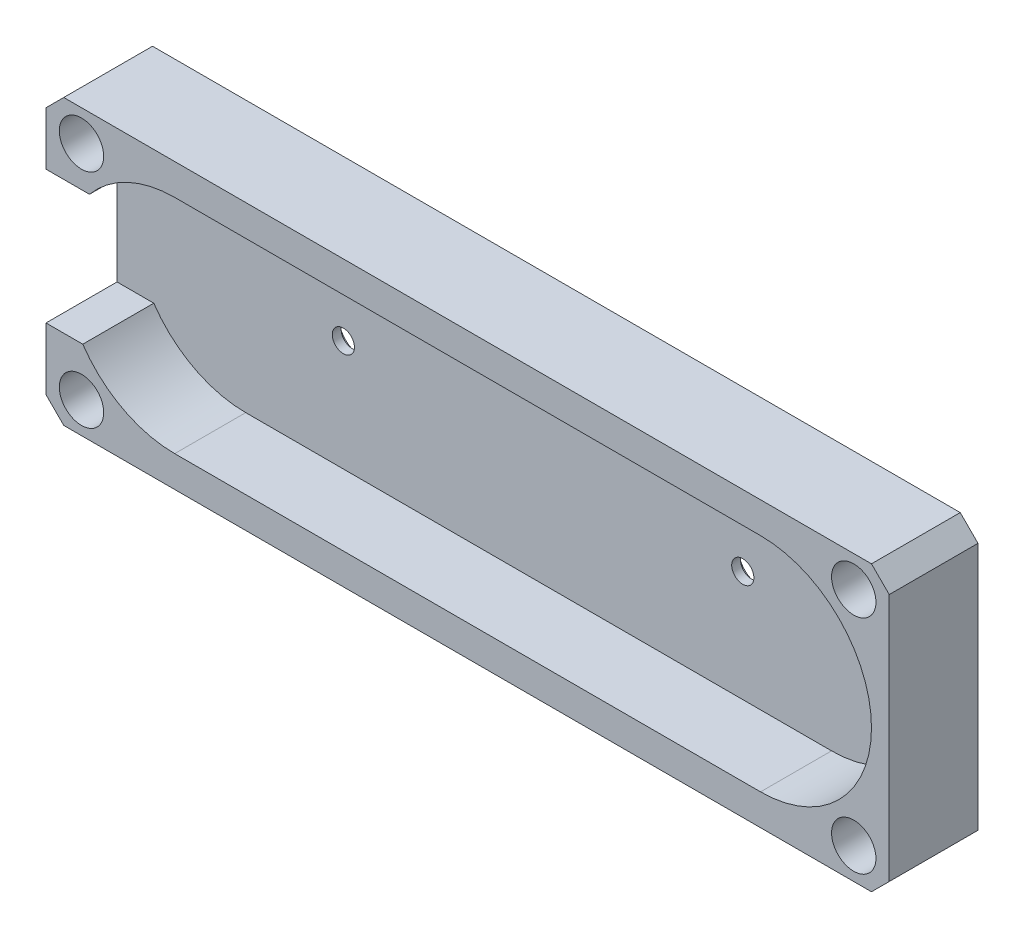
ISO-10303-21;
HEADER;
FILE_DESCRIPTION(('STEP AP214'),'2;1');
FILE_NAME('part.step','',(''),(''),'','','');
FILE_SCHEMA(('AUTOMOTIVE_DESIGN { 1 0 10303 214 1 1 1 1 }'));
ENDSEC;
DATA;
#1=APPLICATION_CONTEXT('core data for automotive mechanical design processes');
#2=APPLICATION_PROTOCOL_DEFINITION('international standard','automotive_design',2000,#1);
#3=PRODUCT_CONTEXT('',#1,'mechanical');
#4=PRODUCT('Part','Part','',(#3));
#5=PRODUCT_RELATED_PRODUCT_CATEGORY('part','',(#4));
#6=PRODUCT_DEFINITION_FORMATION('','',#4);
#7=PRODUCT_DEFINITION_CONTEXT('part definition',#1,'design');
#8=PRODUCT_DEFINITION('design','',#6,#7);
#9=PRODUCT_DEFINITION_SHAPE('','',#8);
#10=(LENGTH_UNIT() NAMED_UNIT(*) SI_UNIT(.MILLI.,.METRE.));
#11=(NAMED_UNIT(*) PLANE_ANGLE_UNIT() SI_UNIT($,.RADIAN.));
#12=(NAMED_UNIT(*) SI_UNIT($,.STERADIAN.) SOLID_ANGLE_UNIT());
#13=UNCERTAINTY_MEASURE_WITH_UNIT(LENGTH_MEASURE(1.E-05),#10,'distance_accuracy_value','');
#14=(GEOMETRIC_REPRESENTATION_CONTEXT(3) GLOBAL_UNCERTAINTY_ASSIGNED_CONTEXT((#13)) GLOBAL_UNIT_ASSIGNED_CONTEXT((#10,
#11,#12)) REPRESENTATION_CONTEXT('',''));
#15=CARTESIAN_POINT('',(0.,0.,0.));
#16=DIRECTION('',(0.,0.,1.));
#17=DIRECTION('',(1.,0.,0.));
#18=AXIS2_PLACEMENT_3D('',#15,#16,#17);
#19=CARTESIAN_POINT('',(-213.530949269792,-7.08637503982973,2.));
#20=DIRECTION('',(0.,0.,-1.));
#21=DIRECTION('',(-1.00000000000005,0.,0.));
#22=AXIS2_PLACEMENT_3D('',#19,#20,#21);
#23=CYLINDRICAL_SURFACE('',#22,1.25000000000001);
#24=CARTESIAN_POINT('',(-213.530949269792,-7.08637503982973,2.));
#25=DIRECTION('',(0.,0.,1.));
#26=DIRECTION('',(1.00000000000005,0.,0.));
#27=AXIS2_PLACEMENT_3D('',#24,#25,#26);
#28=CIRCLE('',#27,1.25000000000001);
#29=CARTESIAN_POINT('',(-212.280949269792,-7.08637503982973,2.));
#30=VERTEX_POINT('',#29);
#31=EDGE_CURVE('E265',#30,#30,#28,.T.);
#32=ORIENTED_EDGE('',*,*,#31,.T.);
#33=EDGE_LOOP('',(#32));
#34=FACE_BOUND('',#33,.T.);
#35=CARTESIAN_POINT('',(-213.530949269792,-7.08637503982973,1.));
#36=DIRECTION('',(0.,0.,-1.));
#37=DIRECTION('',(-1.00000000000005,0.,0.));
#38=AXIS2_PLACEMENT_3D('',#35,#36,#37);
#39=CIRCLE('',#38,1.25000000000001);
#40=CARTESIAN_POINT('',(-214.780949269792,-7.08637503982973,1.));
#41=VERTEX_POINT('',#40);
#42=EDGE_CURVE('E46',#41,#41,#39,.T.);
#43=ORIENTED_EDGE('',*,*,#42,.T.);
#44=EDGE_LOOP('',(#43));
#45=FACE_BOUND('',#44,.T.);
#46=ADVANCED_FACE('F41',(#34,#45),#23,.F.);
#47=CARTESIAN_POINT('',(-168.530949269789,-7.08637503982993,2.));
#48=DIRECTION('',(0.,0.,-1.));
#49=DIRECTION('',(-1.00000000000005,0.,0.));
#50=AXIS2_PLACEMENT_3D('',#47,#48,#49);
#51=CYLINDRICAL_SURFACE('',#50,1.25000000000001);
#52=CARTESIAN_POINT('',(-168.530949269789,-7.08637503982993,2.));
#53=DIRECTION('',(0.,0.,1.));
#54=DIRECTION('',(1.00000000000005,0.,0.));
#55=AXIS2_PLACEMENT_3D('',#52,#53,#54);
#56=CIRCLE('',#55,1.25000000000001);
#57=CARTESIAN_POINT('',(-167.280949269789,-7.08637503982993,2.));
#58=VERTEX_POINT('',#57);
#59=EDGE_CURVE('E262',#58,#58,#56,.T.);
#60=ORIENTED_EDGE('',*,*,#59,.T.);
#61=EDGE_LOOP('',(#60));
#62=FACE_BOUND('',#61,.T.);
#63=CARTESIAN_POINT('',(-168.530949269789,-7.08637503982993,1.));
#64=DIRECTION('',(0.,0.,-1.));
#65=DIRECTION('',(-1.00000000000005,0.,0.));
#66=AXIS2_PLACEMENT_3D('',#63,#64,#65);
#67=CIRCLE('',#66,1.25000000000001);
#68=CARTESIAN_POINT('',(-169.780949269789,-7.08637503982993,1.));
#69=VERTEX_POINT('',#68);
#70=EDGE_CURVE('E217',#69,#69,#67,.T.);
#71=ORIENTED_EDGE('',*,*,#70,.T.);
#72=EDGE_LOOP('',(#71));
#73=FACE_BOUND('',#72,.T.);
#74=ADVANCED_FACE('F384',(#62,#73),#51,.F.);
#75=CARTESIAN_POINT('',(0.,0.,2.));
#76=DIRECTION('',(0.,0.,-1.));
#77=DIRECTION('',(-1.00000000000005,0.,0.));
#78=AXIS2_PLACEMENT_3D('',#75,#76,#77);
#79=PLANE('',#78);
#80=DIRECTION('',(1.00000000000005,0.,0.));
#81=VECTOR('',#80,1.);
#82=CARTESIAN_POINT('',(0.,-19.5863750398303,2.));
#83=LINE('',#82,#81);
#84=CARTESIAN_POINT('',(-224.530949269792,-19.5863750398303,2.));
#85=VERTEX_POINT('',#84);
#86=CARTESIAN_POINT('',(-158.530949269789,-19.5863750398303,2.));
#87=VERTEX_POINT('',#86);
#88=EDGE_CURVE('E187',#85,#87,#83,.T.);
#89=ORIENTED_EDGE('',*,*,#88,.T.);
#90=CARTESIAN_POINT('',(-158.530949269789,-7.08637503982992,2.));
#91=DIRECTION('',(0.,0.,1.));
#92=DIRECTION('',(1.00000000000005,0.,0.));
#93=AXIS2_PLACEMENT_3D('',#90,#91,#92);
#94=CIRCLE('',#93,12.5);
#95=CARTESIAN_POINT('',(-158.530949269789,5.4136249601709,2.));
#96=VERTEX_POINT('',#95);
#97=EDGE_CURVE('E59',#87,#96,#94,.T.);
#98=ORIENTED_EDGE('',*,*,#97,.T.);
#99=DIRECTION('',(1.00000000000005,0.,0.));
#100=VECTOR('',#99,1.);
#101=CARTESIAN_POINT('',(0.,5.41362496017093,2.));
#102=LINE('',#101,#100);
#103=CARTESIAN_POINT('',(-224.530949269792,5.41362496017089,2.));
#104=VERTEX_POINT('',#103);
#105=EDGE_CURVE('E191',#104,#96,#102,.T.);
#106=ORIENTED_EDGE('',*,*,#105,.F.);
#107=CARTESIAN_POINT('',(-224.530949269792,-7.08637503982973,2.));
#108=DIRECTION('',(0.,0.,1.));
#109=DIRECTION('',(1.00000000000005,0.,0.));
#110=AXIS2_PLACEMENT_3D('',#107,#108,#109);
#111=CIRCLE('',#110,12.5);
#112=CARTESIAN_POINT('',(-234.135635625942,0.913624960170556,2.));
#113=VERTEX_POINT('',#112);
#114=EDGE_CURVE('E195',#104,#113,#111,.T.);
#115=ORIENTED_EDGE('',*,*,#114,.T.);
#116=DIRECTION('',(-1.00000000000005,0.,0.));
#117=VECTOR('',#116,1.);
#118=CARTESIAN_POINT('',(-235.530949269792,0.913624960170556,2.));
#119=LINE('',#118,#117);
#120=CARTESIAN_POINT('',(-239.030949269792,0.913624960170556,2.));
#121=VERTEX_POINT('',#120);
#122=EDGE_CURVE('E233',#113,#121,#119,.T.);
#123=ORIENTED_EDGE('',*,*,#122,.T.);
#124=DIRECTION('',(0.,-1.00000000000005,0.));
#125=VECTOR('',#124,1.);
#126=CARTESIAN_POINT('',(-239.030949269792,0.,2.));
#127=LINE('',#126,#125);
#128=CARTESIAN_POINT('',(-239.030949269792,-14.0863750398303,2.));
#129=VERTEX_POINT('',#128);
#130=EDGE_CURVE('E229',#121,#129,#127,.T.);
#131=ORIENTED_EDGE('',*,*,#130,.T.);
#132=DIRECTION('',(-1.00000000000005,0.,0.));
#133=VECTOR('',#132,1.);
#134=CARTESIAN_POINT('',(-235.530949269792,-14.0863750398303,2.));
#135=LINE('',#134,#133);
#136=CARTESIAN_POINT('',(-234.887106858396,-14.0863750398303,2.));
#137=VERTEX_POINT('',#136);
#138=EDGE_CURVE('E168',#137,#129,#135,.T.);
#139=ORIENTED_EDGE('',*,*,#138,.F.);
#140=CARTESIAN_POINT('',(-224.530949269792,-7.08637503982973,2.));
#141=DIRECTION('',(0.,0.,1.));
#142=DIRECTION('',(1.00000000000005,0.,0.));
#143=AXIS2_PLACEMENT_3D('',#140,#141,#142);
#144=CIRCLE('',#143,12.5);
#145=EDGE_CURVE('E66',#137,#85,#144,.T.);
#146=ORIENTED_EDGE('',*,*,#145,.T.);
#147=EDGE_LOOP('',(#89,#98,#106,#115,#123,#131,#139,#146));
#148=FACE_BOUND('',#147,.T.);
#149=ORIENTED_EDGE('',*,*,#31,.F.);
#150=EDGE_LOOP('',(#149));
#151=FACE_BOUND('',#150,.T.);
#152=ORIENTED_EDGE('',*,*,#59,.F.);
#153=EDGE_LOOP('',(#152));
#154=FACE_BOUND('',#153,.T.);
#155=ADVANCED_FACE('F329',(#148,#151,#154),#79,.F.);
#156=CARTESIAN_POINT('',(0.,0.,0.));
#157=DIRECTION('',(0.,0.,-1.));
#158=DIRECTION('',(-1.00000000000005,0.,0.));
#159=AXIS2_PLACEMENT_3D('',#156,#157,#158);
#160=PLANE('',#159);
#161=CARTESIAN_POINT('',(-235.030949269792,-19.5863750398303,0.));
#162=DIRECTION('',(0.,0.,1.));
#163=DIRECTION('',(1.00000000000005,0.,0.));
#164=AXIS2_PLACEMENT_3D('',#161,#162,#163);
#165=CIRCLE('',#164,2.5);
#166=CARTESIAN_POINT('',(-232.530949269792,-19.5863750398303,0.));
#167=VERTEX_POINT('',#166);
#168=EDGE_CURVE('E578',#167,#167,#165,.T.);
#169=ORIENTED_EDGE('',*,*,#168,.T.);
#170=EDGE_LOOP('',(#169));
#171=FACE_BOUND('',#170,.T.);
#172=CARTESIAN_POINT('',(-148.030949269789,5.41362496017091,0.));
#173=DIRECTION('',(0.,0.,1.));
#174=DIRECTION('',(1.00000000000005,0.,0.));
#175=AXIS2_PLACEMENT_3D('',#172,#173,#174);
#176=CIRCLE('',#175,2.49999999999392);
#177=CARTESIAN_POINT('',(-145.530949269795,5.41362496017091,0.));
#178=VERTEX_POINT('',#177);
#179=EDGE_CURVE('E593',#178,#178,#176,.T.);
#180=ORIENTED_EDGE('',*,*,#179,.T.);
#181=EDGE_LOOP('',(#180));
#182=FACE_BOUND('',#181,.T.);
#183=CARTESIAN_POINT('',(-235.030949269792,5.41362496017091,0.));
#184=DIRECTION('',(0.,0.,1.));
#185=DIRECTION('',(1.00000000000005,0.,0.));
#186=AXIS2_PLACEMENT_3D('',#183,#184,#185);
#187=CIRCLE('',#186,2.49999999998457);
#188=CARTESIAN_POINT('',(-232.530949269808,5.41362496017091,0.));
#189=VERTEX_POINT('',#188);
#190=EDGE_CURVE('E588',#189,#189,#187,.T.);
#191=ORIENTED_EDGE('',*,*,#190,.T.);
#192=EDGE_LOOP('',(#191));
#193=FACE_BOUND('',#192,.T.);
#194=CARTESIAN_POINT('',(-148.030949269789,-19.5863750398303,0.));
#195=DIRECTION('',(0.,0.,1.));
#196=DIRECTION('',(1.00000000000005,0.,0.));
#197=AXIS2_PLACEMENT_3D('',#194,#195,#196);
#198=CIRCLE('',#197,2.5);
#199=CARTESIAN_POINT('',(-145.530949269789,-19.5863750398303,0.));
#200=VERTEX_POINT('',#199);
#201=EDGE_CURVE('E375',#200,#200,#198,.T.);
#202=ORIENTED_EDGE('',*,*,#201,.T.);
#203=EDGE_LOOP('',(#202));
#204=FACE_BOUND('',#203,.T.);
#205=CARTESIAN_POINT('',(-168.530949269789,-7.08637503982993,0.));
#206=DIRECTION('',(0.,0.,-1.));
#207=DIRECTION('',(-1.00000000000005,0.,0.));
#208=AXIS2_PLACEMENT_3D('',#205,#206,#207);
#209=CIRCLE('',#208,2.5);
#210=CARTESIAN_POINT('',(-171.030949269789,-7.08637503982993,0.));
#211=VERTEX_POINT('',#210);
#212=EDGE_CURVE('E218',#211,#211,#209,.T.);
#213=ORIENTED_EDGE('',*,*,#212,.F.);
#214=EDGE_LOOP('',(#213));
#215=FACE_BOUND('',#214,.T.);
#216=CARTESIAN_POINT('',(-213.530949269792,-7.08637503982973,0.));
#217=DIRECTION('',(0.,0.,-1.));
#218=DIRECTION('',(-1.00000000000005,0.,0.));
#219=AXIS2_PLACEMENT_3D('',#216,#217,#218);
#220=CIRCLE('',#219,2.5);
#221=CARTESIAN_POINT('',(-216.030949269792,-7.08637503982973,0.));
#222=VERTEX_POINT('',#221);
#223=EDGE_CURVE('E221',#222,#222,#220,.T.);
#224=ORIENTED_EDGE('',*,*,#223,.F.);
#225=EDGE_LOOP('',(#224));
#226=FACE_BOUND('',#225,.T.);
#227=DIRECTION('',(0.,1.00000000000005,0.));
#228=VECTOR('',#227,1.);
#229=CARTESIAN_POINT('',(-144.030949269786,8.9136249601709,0.));
#230=LINE('',#229,#228);
#231=CARTESIAN_POINT('',(-144.030949269786,-21.0863750398303,0.));
#232=VERTEX_POINT('',#231);
#233=CARTESIAN_POINT('',(-144.030949269786,6.9136249601709,0.));
#234=VERTEX_POINT('',#233);
#235=EDGE_CURVE('E268',#232,#234,#230,.T.);
#236=ORIENTED_EDGE('',*,*,#235,.F.);
#237=DIRECTION('',(0.707106781186576,0.707106781186571,0.));
#238=VECTOR('',#237,1.);
#239=CARTESIAN_POINT('',(-61.4722871149809,61.472287114978,0.));
#240=LINE('',#239,#238);
#241=CARTESIAN_POINT('',(-146.030949269789,-23.0863750398303,0.));
#242=VERTEX_POINT('',#241);
#243=EDGE_CURVE('E291',#232,#242,#240,.F.);
#244=ORIENTED_EDGE('',*,*,#243,.T.);
#245=DIRECTION('',(1.00000000000005,0.,0.));
#246=VECTOR('',#245,1.);
#247=CARTESIAN_POINT('',(-144.030949269786,-23.0863750398303,0.));
#248=LINE('',#247,#246);
#249=CARTESIAN_POINT('',(-237.030949269792,-23.0863750398303,0.));
#250=VERTEX_POINT('',#249);
#251=EDGE_CURVE('E277',#250,#242,#248,.T.);
#252=ORIENTED_EDGE('',*,*,#251,.F.);
#253=DIRECTION('',(0.707106781186576,-0.707106781186571,0.));
#254=VECTOR('',#253,1.);
#255=CARTESIAN_POINT('',(-130.05866215481,-130.058662154811,0.));
#256=LINE('',#255,#254);
#257=CARTESIAN_POINT('',(-239.030949269792,-21.0863750398304,0.));
#258=VERTEX_POINT('',#257);
#259=EDGE_CURVE('E287',#250,#258,#256,.F.);
#260=ORIENTED_EDGE('',*,*,#259,.T.);
#261=DIRECTION('',(0.,-1.00000000000005,0.));
#262=VECTOR('',#261,1.);
#263=CARTESIAN_POINT('',(-239.030949269792,8.9136249601713,0.));
#264=LINE('',#263,#262);
#265=CARTESIAN_POINT('',(-239.030949269792,6.9136249601713,0.));
#266=VERTEX_POINT('',#265);
#267=EDGE_CURVE('E274',#266,#258,#264,.T.);
#268=ORIENTED_EDGE('',*,*,#267,.F.);
#269=DIRECTION('',(-0.707106781186579,-0.707106781186569,0.));
#270=VECTOR('',#269,1.);
#271=CARTESIAN_POINT('',(-122.972287114981,122.972287114981,0.));
#272=LINE('',#271,#270);
#273=CARTESIAN_POINT('',(-237.030949269792,8.9136249601713,0.));
#274=VERTEX_POINT('',#273);
#275=EDGE_CURVE('E285',#266,#274,#272,.F.);
#276=ORIENTED_EDGE('',*,*,#275,.T.);
#277=DIRECTION('',(-1.00000000000005,0.,0.));
#278=VECTOR('',#277,1.);
#279=CARTESIAN_POINT('',(-144.030949269786,8.9136249601709,0.));
#280=LINE('',#279,#278);
#281=CARTESIAN_POINT('',(-146.030949269789,8.9136249601709,0.));
#282=VERTEX_POINT('',#281);
#283=EDGE_CURVE('E271',#282,#274,#280,.T.);
#284=ORIENTED_EDGE('',*,*,#283,.F.);
#285=DIRECTION('',(-0.707106781186574,0.707106781186574,0.));
#286=VECTOR('',#285,1.);
#287=CARTESIAN_POINT('',(-68.5586621548093,-68.5586621548076,0.));
#288=LINE('',#287,#286);
#289=EDGE_CURVE('E289',#282,#234,#288,.F.);
#290=ORIENTED_EDGE('',*,*,#289,.T.);
#291=EDGE_LOOP('',(#236,#244,#252,#260,#268,#276,#284,#290));
#292=FACE_BOUND('',#291,.T.);
#293=ADVANCED_FACE('F325',(#171,#182,#193,#204,#215,#226,#292),#160,.T.);
#294=CARTESIAN_POINT('',(-144.030949269786,8.9136249601709,2.));
#295=DIRECTION('',(-1.00000000000005,0.,0.));
#296=DIRECTION('',(0.,-1.00000000000005,0.));
#297=AXIS2_PLACEMENT_3D('',#294,#295,#296);
#298=PLANE('',#297);
#299=DIRECTION('',(0.,0.,1.));
#300=VECTOR('',#299,1.);
#301=CARTESIAN_POINT('',(-144.030949269786,6.9136249601709,2.));
#302=LINE('',#301,#300);
#303=CARTESIAN_POINT('',(-144.030949269786,6.9136249601709,10.));
#304=VERTEX_POINT('',#303);
#305=EDGE_CURVE('E280',#234,#304,#302,.T.);
#306=ORIENTED_EDGE('',*,*,#305,.T.);
#307=DIRECTION('',(0.,1.00000000000005,0.));
#308=VECTOR('',#307,1.);
#309=CARTESIAN_POINT('',(-144.030949269786,-21.0863750398303,10.));
#310=LINE('',#309,#308);
#311=CARTESIAN_POINT('',(-144.030949269786,-21.0863750398303,10.));
#312=VERTEX_POINT('',#311);
#313=EDGE_CURVE('E259',#312,#304,#310,.T.);
#314=ORIENTED_EDGE('',*,*,#313,.F.);
#315=DIRECTION('',(0.,0.,-1.));
#316=VECTOR('',#315,1.);
#317=CARTESIAN_POINT('',(-144.030949269786,-21.0863750398303,2.));
#318=LINE('',#317,#316);
#319=EDGE_CURVE('E282',#312,#232,#318,.T.);
#320=ORIENTED_EDGE('',*,*,#319,.T.);
#321=ORIENTED_EDGE('',*,*,#235,.T.);
#322=EDGE_LOOP('',(#306,#314,#320,#321));
#323=FACE_BOUND('',#322,.T.);
#324=ADVANCED_FACE('F328',(#323),#298,.F.);
#325=CARTESIAN_POINT('',(-144.030949269786,8.9136249601709,2.));
#326=DIRECTION('',(0.,-1.00000000000005,0.));
#327=DIRECTION('',(1.00000000000005,0.,0.));
#328=AXIS2_PLACEMENT_3D('',#325,#326,#327);
#329=PLANE('',#328);
#330=DIRECTION('',(0.,0.,1.));
#331=VECTOR('',#330,1.);
#332=CARTESIAN_POINT('',(-237.030949269792,8.9136249601713,2.));
#333=LINE('',#332,#331);
#334=CARTESIAN_POINT('',(-237.030949269792,8.9136249601713,10.));
#335=VERTEX_POINT('',#334);
#336=EDGE_CURVE('E298',#274,#335,#333,.T.);
#337=ORIENTED_EDGE('',*,*,#336,.T.);
#338=DIRECTION('',(-1.00000000000005,0.,0.));
#339=VECTOR('',#338,1.);
#340=CARTESIAN_POINT('',(-146.030949269789,8.9136249601709,10.));
#341=LINE('',#340,#339);
#342=CARTESIAN_POINT('',(-146.030949269789,8.9136249601709,10.));
#343=VERTEX_POINT('',#342);
#344=EDGE_CURVE('E240',#343,#335,#341,.T.);
#345=ORIENTED_EDGE('',*,*,#344,.F.);
#346=DIRECTION('',(0.,0.,-1.));
#347=VECTOR('',#346,1.);
#348=CARTESIAN_POINT('',(-146.030949269789,8.9136249601709,2.));
#349=LINE('',#348,#347);
#350=EDGE_CURVE('E300',#343,#282,#349,.T.);
#351=ORIENTED_EDGE('',*,*,#350,.T.);
#352=ORIENTED_EDGE('',*,*,#283,.T.);
#353=EDGE_LOOP('',(#337,#345,#351,#352));
#354=FACE_BOUND('',#353,.T.);
#355=ADVANCED_FACE('F400',(#354),#329,.F.);
#356=CARTESIAN_POINT('',(-239.030949269792,8.9136249601713,2.));
#357=DIRECTION('',(1.00000000000005,0.,0.));
#358=DIRECTION('',(0.,0.,-1.));
#359=AXIS2_PLACEMENT_3D('',#356,#357,#358);
#360=PLANE('',#359);
#361=ORIENTED_EDGE('',*,*,#130,.F.);
#362=DIRECTION('',(0.,0.,-1.));
#363=VECTOR('',#362,1.);
#364=CARTESIAN_POINT('',(-239.030949269792,0.913624960170556,0.));
#365=LINE('',#364,#363);
#366=CARTESIAN_POINT('',(-239.030949269792,0.913624960170556,10.));
#367=VERTEX_POINT('',#366);
#368=EDGE_CURVE('E226',#367,#121,#365,.T.);
#369=ORIENTED_EDGE('',*,*,#368,.F.);
#370=DIRECTION('',(0.,-1.00000000000005,0.));
#371=VECTOR('',#370,1.);
#372=CARTESIAN_POINT('',(-239.030949269792,6.9136249601713,10.));
#373=LINE('',#372,#371);
#374=CARTESIAN_POINT('',(-239.030949269792,6.9136249601713,10.));
#375=VERTEX_POINT('',#374);
#376=EDGE_CURVE('E247',#375,#367,#373,.T.);
#377=ORIENTED_EDGE('',*,*,#376,.F.);
#378=DIRECTION('',(0.,0.,-1.));
#379=VECTOR('',#378,1.);
#380=CARTESIAN_POINT('',(-239.030949269792,6.9136249601713,2.));
#381=LINE('',#380,#379);
#382=EDGE_CURVE('E51',#375,#266,#381,.T.);
#383=ORIENTED_EDGE('',*,*,#382,.T.);
#384=ORIENTED_EDGE('',*,*,#267,.T.);
#385=DIRECTION('',(0.,0.,1.));
#386=VECTOR('',#385,1.);
#387=CARTESIAN_POINT('',(-239.030949269792,-21.0863750398304,2.));
#388=LINE('',#387,#386);
#389=CARTESIAN_POINT('',(-239.030949269792,-21.0863750398304,10.));
#390=VERTEX_POINT('',#389);
#391=EDGE_CURVE('E11',#258,#390,#388,.T.);
#392=ORIENTED_EDGE('',*,*,#391,.T.);
#393=CARTESIAN_POINT('',(-239.030949269792,-14.0863750398303,10.));
#394=VERTEX_POINT('',#393);
#395=EDGE_CURVE('E246',#394,#390,#373,.T.);
#396=ORIENTED_EDGE('',*,*,#395,.F.);
#397=DIRECTION('',(0.,0.,-1.));
#398=VECTOR('',#397,1.);
#399=CARTESIAN_POINT('',(-239.030949269792,-14.0863750398303,0.));
#400=LINE('',#399,#398);
#401=EDGE_CURVE('E163',#394,#129,#400,.T.);
#402=ORIENTED_EDGE('',*,*,#401,.T.);
#403=EDGE_LOOP('',(#361,#369,#377,#383,#384,#392,#396,#402));
#404=FACE_BOUND('',#403,.T.);
#405=ADVANCED_FACE('F355',(#404),#360,.F.);
#406=CARTESIAN_POINT('',(-144.030949269786,-23.0863750398303,2.));
#407=DIRECTION('',(0.,1.00000000000005,0.));
#408=DIRECTION('',(-1.00000000000005,0.,0.));
#409=AXIS2_PLACEMENT_3D('',#406,#407,#408);
#410=PLANE('',#409);
#411=ORIENTED_EDGE('',*,*,#251,.T.);
#412=DIRECTION('',(0.,0.,1.));
#413=VECTOR('',#412,1.);
#414=CARTESIAN_POINT('',(-146.030949269789,-23.0863750398303,2.));
#415=LINE('',#414,#413);
#416=CARTESIAN_POINT('',(-146.030949269789,-23.0863750398303,10.));
#417=VERTEX_POINT('',#416);
#418=EDGE_CURVE('E296',#242,#417,#415,.T.);
#419=ORIENTED_EDGE('',*,*,#418,.T.);
#420=DIRECTION('',(1.00000000000005,0.,0.));
#421=VECTOR('',#420,1.);
#422=CARTESIAN_POINT('',(-237.030949269792,-23.0863750398303,10.));
#423=LINE('',#422,#421);
#424=CARTESIAN_POINT('',(-237.030949269792,-23.0863750398303,10.));
#425=VERTEX_POINT('',#424);
#426=EDGE_CURVE('E253',#425,#417,#423,.T.);
#427=ORIENTED_EDGE('',*,*,#426,.F.);
#428=DIRECTION('',(0.,0.,-1.));
#429=VECTOR('',#428,1.);
#430=CARTESIAN_POINT('',(-237.030949269792,-23.0863750398303,2.));
#431=LINE('',#430,#429);
#432=EDGE_CURVE('E293',#425,#250,#431,.T.);
#433=ORIENTED_EDGE('',*,*,#432,.T.);
#434=EDGE_LOOP('',(#411,#419,#427,#433));
#435=FACE_BOUND('',#434,.T.);
#436=ADVANCED_FACE('F349',(#435),#410,.F.);
#437=CARTESIAN_POINT('',(-144.030949269786,-21.0863750398303,2.));
#438=DIRECTION('',(-0.707106781186571,0.707106781186576,0.));
#439=DIRECTION('',(0.,0.,-1.));
#440=AXIS2_PLACEMENT_3D('',#437,#438,#439);
#441=PLANE('',#440);
#442=ORIENTED_EDGE('',*,*,#319,.F.);
#443=DIRECTION('',(0.707106781186577,0.707106781186571,0.));
#444=VECTOR('',#443,1.);
#445=CARTESIAN_POINT('',(-146.030949269789,-23.0863750398303,10.));
#446=LINE('',#445,#444);
#447=EDGE_CURVE('E256',#417,#312,#446,.T.);
#448=ORIENTED_EDGE('',*,*,#447,.F.);
#449=ORIENTED_EDGE('',*,*,#418,.F.);
#450=ORIENTED_EDGE('',*,*,#243,.F.);
#451=EDGE_LOOP('',(#442,#448,#449,#450));
#452=FACE_BOUND('',#451,.T.);
#453=ADVANCED_FACE('F347',(#452),#441,.F.);
#454=CARTESIAN_POINT('',(-146.030949269789,8.9136249601709,2.));
#455=DIRECTION('',(-0.707106781186574,-0.707106781186574,0.));
#456=DIRECTION('',(0.,0.,-1.));
#457=AXIS2_PLACEMENT_3D('',#454,#455,#456);
#458=PLANE('',#457);
#459=ORIENTED_EDGE('',*,*,#350,.F.);
#460=DIRECTION('',(-0.707106781186573,0.707106781186574,0.));
#461=VECTOR('',#460,1.);
#462=CARTESIAN_POINT('',(-144.030949269786,6.9136249601709,10.));
#463=LINE('',#462,#461);
#464=EDGE_CURVE('E234',#304,#343,#463,.T.);
#465=ORIENTED_EDGE('',*,*,#464,.F.);
#466=ORIENTED_EDGE('',*,*,#305,.F.);
#467=ORIENTED_EDGE('',*,*,#289,.F.);
#468=EDGE_LOOP('',(#459,#465,#466,#467));
#469=FACE_BOUND('',#468,.T.);
#470=ADVANCED_FACE('F340',(#469),#458,.F.);
#471=CARTESIAN_POINT('',(-237.030949269792,-23.0863750398303,2.));
#472=DIRECTION('',(0.707106781186571,0.707106781186576,0.));
#473=DIRECTION('',(0.,0.,-1.));
#474=AXIS2_PLACEMENT_3D('',#471,#472,#473);
#475=PLANE('',#474);
#476=ORIENTED_EDGE('',*,*,#432,.F.);
#477=DIRECTION('',(0.707106781186576,-0.707106781186571,0.));
#478=VECTOR('',#477,1.);
#479=CARTESIAN_POINT('',(-239.030949269792,-21.0863750398304,10.));
#480=LINE('',#479,#478);
#481=EDGE_CURVE('E250',#390,#425,#480,.T.);
#482=ORIENTED_EDGE('',*,*,#481,.F.);
#483=ORIENTED_EDGE('',*,*,#391,.F.);
#484=ORIENTED_EDGE('',*,*,#259,.F.);
#485=EDGE_LOOP('',(#476,#482,#483,#484));
#486=FACE_BOUND('',#485,.T.);
#487=ADVANCED_FACE('F358',(#486),#475,.F.);
#488=CARTESIAN_POINT('',(-239.030949269792,6.9136249601713,2.));
#489=DIRECTION('',(0.707106781186569,-0.707106781186579,0.));
#490=DIRECTION('',(0.,0.,-1.));
#491=AXIS2_PLACEMENT_3D('',#488,#489,#490);
#492=PLANE('',#491);
#493=ORIENTED_EDGE('',*,*,#382,.F.);
#494=DIRECTION('',(-0.707106781186579,-0.707106781186569,0.));
#495=VECTOR('',#494,1.);
#496=CARTESIAN_POINT('',(-237.030949269792,8.9136249601713,10.));
#497=LINE('',#496,#495);
#498=EDGE_CURVE('E243',#335,#375,#497,.T.);
#499=ORIENTED_EDGE('',*,*,#498,.F.);
#500=ORIENTED_EDGE('',*,*,#336,.F.);
#501=ORIENTED_EDGE('',*,*,#275,.F.);
#502=EDGE_LOOP('',(#493,#499,#500,#501));
#503=FACE_BOUND('',#502,.T.);
#504=ADVANCED_FACE('F44',(#503),#492,.F.);
#505=CARTESIAN_POINT('',(0.,0.,10.));
#506=DIRECTION('',(0.,0.,1.));
#507=DIRECTION('',(1.00000000000005,0.,0.));
#508=AXIS2_PLACEMENT_3D('',#505,#506,#507);
#509=PLANE('',#508);
#510=CARTESIAN_POINT('',(-235.030949269792,-19.5863750398303,10.));
#511=DIRECTION('',(0.,0.,1.));
#512=DIRECTION('',(1.00000000000005,0.,0.));
#513=AXIS2_PLACEMENT_3D('',#510,#511,#512);
#514=CIRCLE('',#513,2.5);
#515=CARTESIAN_POINT('',(-232.530949269792,-19.5863750398303,10.));
#516=VERTEX_POINT('',#515);
#517=EDGE_CURVE('E580',#516,#516,#514,.T.);
#518=ORIENTED_EDGE('',*,*,#517,.F.);
#519=EDGE_LOOP('',(#518));
#520=FACE_BOUND('',#519,.T.);
#521=CARTESIAN_POINT('',(-148.030949269789,5.41362496017091,10.));
#522=DIRECTION('',(0.,0.,1.));
#523=DIRECTION('',(1.00000000000005,0.,0.));
#524=AXIS2_PLACEMENT_3D('',#521,#522,#523);
#525=CIRCLE('',#524,2.49999999999392);
#526=CARTESIAN_POINT('',(-145.530949269795,5.41362496017091,10.));
#527=VERTEX_POINT('',#526);
#528=EDGE_CURVE('E585',#527,#527,#525,.T.);
#529=ORIENTED_EDGE('',*,*,#528,.F.);
#530=EDGE_LOOP('',(#529));
#531=FACE_BOUND('',#530,.T.);
#532=CARTESIAN_POINT('',(-235.030949269792,5.41362496017091,10.));
#533=DIRECTION('',(0.,0.,1.));
#534=DIRECTION('',(1.00000000000005,0.,0.));
#535=AXIS2_PLACEMENT_3D('',#532,#533,#534);
#536=CIRCLE('',#535,2.49999999998457);
#537=CARTESIAN_POINT('',(-232.530949269808,5.41362496017091,10.));
#538=VERTEX_POINT('',#537);
#539=EDGE_CURVE('E596',#538,#538,#536,.T.);
#540=ORIENTED_EDGE('',*,*,#539,.F.);
#541=EDGE_LOOP('',(#540));
#542=FACE_BOUND('',#541,.T.);
#543=CARTESIAN_POINT('',(-148.030949269789,-19.5863750398303,10.));
#544=DIRECTION('',(0.,0.,1.));
#545=DIRECTION('',(1.00000000000005,0.,0.));
#546=AXIS2_PLACEMENT_3D('',#543,#544,#545);
#547=CIRCLE('',#546,2.5);
#548=CARTESIAN_POINT('',(-145.530949269789,-19.5863750398303,10.));
#549=VERTEX_POINT('',#548);
#550=EDGE_CURVE('E581',#549,#549,#547,.T.);
#551=ORIENTED_EDGE('',*,*,#550,.F.);
#552=EDGE_LOOP('',(#551));
#553=FACE_BOUND('',#552,.T.);
#554=DIRECTION('',(-1.00000000000005,0.,0.));
#555=VECTOR('',#554,1.);
#556=CARTESIAN_POINT('',(-235.530949269792,0.913624960170556,10.));
#557=LINE('',#556,#555);
#558=CARTESIAN_POINT('',(-234.135635625942,0.913624960170556,10.));
#559=VERTEX_POINT('',#558);
#560=EDGE_CURVE('E167',#559,#367,#557,.T.);
#561=ORIENTED_EDGE('',*,*,#560,.F.);
#562=CARTESIAN_POINT('',(-224.530949269792,-7.08637503982973,9.99999999999999));
#563=DIRECTION('',(0.,0.,1.));
#564=DIRECTION('',(1.00000000000005,0.,0.));
#565=AXIS2_PLACEMENT_3D('',#562,#563,#564);
#566=CIRCLE('',#565,12.5);
#567=CARTESIAN_POINT('',(-224.530949269792,5.41362496017089,10.));
#568=VERTEX_POINT('',#567);
#569=EDGE_CURVE('E200',#568,#559,#566,.T.);
#570=ORIENTED_EDGE('',*,*,#569,.F.);
#571=DIRECTION('',(1.00000000000005,0.,0.));
#572=VECTOR('',#571,1.);
#573=CARTESIAN_POINT('',(0.,5.41362496017093,9.99999999999999));
#574=LINE('',#573,#572);
#575=CARTESIAN_POINT('',(-158.530949269789,5.4136249601709,9.99999999999999));
#576=VERTEX_POINT('',#575);
#577=EDGE_CURVE('E198',#568,#576,#574,.T.);
#578=ORIENTED_EDGE('',*,*,#577,.T.);
#579=CARTESIAN_POINT('',(-158.530949269789,-7.08637503982992,9.99999999999999));
#580=DIRECTION('',(0.,0.,1.));
#581=DIRECTION('',(1.00000000000005,0.,0.));
#582=AXIS2_PLACEMENT_3D('',#579,#580,#581);
#583=CIRCLE('',#582,12.5);
#584=CARTESIAN_POINT('',(-158.530949269789,-19.5863750398303,10.));
#585=VERTEX_POINT('',#584);
#586=EDGE_CURVE('E189',#585,#576,#583,.T.);
#587=ORIENTED_EDGE('',*,*,#586,.F.);
#588=DIRECTION('',(1.00000000000005,0.,0.));
#589=VECTOR('',#588,1.);
#590=CARTESIAN_POINT('',(0.,-19.5863750398303,9.99999999999999));
#591=LINE('',#590,#589);
#592=CARTESIAN_POINT('',(-224.530949269792,-19.5863750398303,10.));
#593=VERTEX_POINT('',#592);
#594=EDGE_CURVE('E179',#593,#585,#591,.T.);
#595=ORIENTED_EDGE('',*,*,#594,.F.);
#596=CARTESIAN_POINT('',(-224.530949269792,-7.08637503982973,9.99999999999999));
#597=DIRECTION('',(0.,0.,1.));
#598=DIRECTION('',(1.00000000000005,0.,0.));
#599=AXIS2_PLACEMENT_3D('',#596,#597,#598);
#600=CIRCLE('',#599,12.5);
#601=CARTESIAN_POINT('',(-234.887106858396,-14.0863750398303,10.));
#602=VERTEX_POINT('',#601);
#603=EDGE_CURVE('E172',#602,#593,#600,.T.);
#604=ORIENTED_EDGE('',*,*,#603,.F.);
#605=DIRECTION('',(-1.00000000000005,0.,0.));
#606=VECTOR('',#605,1.);
#607=CARTESIAN_POINT('',(-235.530949269792,-14.0863750398303,10.));
#608=LINE('',#607,#606);
#609=EDGE_CURVE('E158',#602,#394,#608,.T.);
#610=ORIENTED_EDGE('',*,*,#609,.T.);
#611=ORIENTED_EDGE('',*,*,#395,.T.);
#612=ORIENTED_EDGE('',*,*,#481,.T.);
#613=ORIENTED_EDGE('',*,*,#426,.T.);
#614=ORIENTED_EDGE('',*,*,#447,.T.);
#615=ORIENTED_EDGE('',*,*,#313,.T.);
#616=ORIENTED_EDGE('',*,*,#464,.T.);
#617=ORIENTED_EDGE('',*,*,#344,.T.);
#618=ORIENTED_EDGE('',*,*,#498,.T.);
#619=ORIENTED_EDGE('',*,*,#376,.T.);
#620=EDGE_LOOP('',(#561,#570,#578,#587,#595,#604,#610,#611,#612,#613,#614,#615,#616,#617,#618,#619));
#621=FACE_BOUND('',#620,.T.);
#622=ADVANCED_FACE('F177',(#520,#531,#542,#553,#621),#509,.T.);
#623=CARTESIAN_POINT('',(-235.530949269792,0.913624960170556,0.));
#624=DIRECTION('',(0.,1.00000000000005,0.));
#625=DIRECTION('',(0.,0.,1.));
#626=AXIS2_PLACEMENT_3D('',#623,#624,#625);
#627=PLANE('',#626);
#628=ORIENTED_EDGE('',*,*,#122,.F.);
#629=DIRECTION('',(0.,0.,-1.));
#630=VECTOR('',#629,1.);
#631=CARTESIAN_POINT('',(-234.135635625942,0.913624960170556,102.070625065761));
#632=LINE('',#631,#630);
#633=EDGE_CURVE('E203',#559,#113,#632,.T.);
#634=ORIENTED_EDGE('',*,*,#633,.F.);
#635=ORIENTED_EDGE('',*,*,#560,.T.);
#636=ORIENTED_EDGE('',*,*,#368,.T.);
#637=EDGE_LOOP('',(#628,#634,#635,#636));
#638=FACE_BOUND('',#637,.T.);
#639=ADVANCED_FACE('F365',(#638),#627,.F.);
#640=CARTESIAN_POINT('',(-235.530949269792,-14.0863750398303,0.));
#641=DIRECTION('',(0.,1.00000000000005,0.));
#642=DIRECTION('',(0.,0.,1.));
#643=AXIS2_PLACEMENT_3D('',#640,#641,#642);
#644=PLANE('',#643);
#645=ORIENTED_EDGE('',*,*,#138,.T.);
#646=ORIENTED_EDGE('',*,*,#401,.F.);
#647=ORIENTED_EDGE('',*,*,#609,.F.);
#648=DIRECTION('',(0.,0.,-1.));
#649=VECTOR('',#648,1.);
#650=CARTESIAN_POINT('',(-234.887106858396,-14.0863750398303,102.070625065761));
#651=LINE('',#650,#649);
#652=EDGE_CURVE('E161',#602,#137,#651,.T.);
#653=ORIENTED_EDGE('',*,*,#652,.T.);
#654=EDGE_LOOP('',(#645,#646,#647,#653));
#655=FACE_BOUND('',#654,.T.);
#656=ADVANCED_FACE('F160',(#655),#644,.T.);
#657=CARTESIAN_POINT('',(-168.530949269789,-7.08637503982993,1.));
#658=DIRECTION('',(0.,0.,-1.));
#659=DIRECTION('',(-1.00000000000005,0.,0.));
#660=AXIS2_PLACEMENT_3D('',#657,#658,#659);
#661=CYLINDRICAL_SURFACE('',#660,2.5);
#662=CARTESIAN_POINT('',(-168.530949269789,-7.08637503982993,1.));
#663=DIRECTION('',(0.,0.,-1.));
#664=DIRECTION('',(-1.00000000000005,0.,0.));
#665=AXIS2_PLACEMENT_3D('',#662,#663,#664);
#666=CIRCLE('',#665,2.5);
#667=CARTESIAN_POINT('',(-171.030949269789,-7.08637503982993,1.));
#668=VERTEX_POINT('',#667);
#669=EDGE_CURVE('E214',#668,#668,#666,.T.);
#670=ORIENTED_EDGE('',*,*,#669,.F.);
#671=EDGE_LOOP('',(#670));
#672=FACE_BOUND('',#671,.T.);
#673=ORIENTED_EDGE('',*,*,#212,.T.);
#674=EDGE_LOOP('',(#673));
#675=FACE_BOUND('',#674,.T.);
#676=ADVANCED_FACE('F436',(#672,#675),#661,.F.);
#677=CARTESIAN_POINT('',(-168.530949269789,-7.08637503982993,1.));
#678=DIRECTION('',(0.,0.,-1.));
#679=DIRECTION('',(-1.00000000000005,0.,0.));
#680=AXIS2_PLACEMENT_3D('',#677,#678,#679);
#681=PLANE('',#680);
#682=ORIENTED_EDGE('',*,*,#70,.F.);
#683=EDGE_LOOP('',(#682));
#684=FACE_BOUND('',#683,.T.);
#685=ORIENTED_EDGE('',*,*,#669,.T.);
#686=EDGE_LOOP('',(#685));
#687=FACE_BOUND('',#686,.T.);
#688=ADVANCED_FACE('F321',(#684,#687),#681,.T.);
#689=CARTESIAN_POINT('',(-213.530949269792,-7.08637503982973,1.));
#690=DIRECTION('',(0.,0.,-1.));
#691=DIRECTION('',(-1.00000000000005,0.,0.));
#692=AXIS2_PLACEMENT_3D('',#689,#690,#691);
#693=CYLINDRICAL_SURFACE('',#692,2.5);
#694=CARTESIAN_POINT('',(-213.530949269792,-7.08637503982973,1.));
#695=DIRECTION('',(0.,0.,-1.));
#696=DIRECTION('',(-1.00000000000005,0.,0.));
#697=AXIS2_PLACEMENT_3D('',#694,#695,#696);
#698=CIRCLE('',#697,2.5);
#699=CARTESIAN_POINT('',(-216.030949269792,-7.08637503982973,1.));
#700=VERTEX_POINT('',#699);
#701=EDGE_CURVE('E209',#700,#700,#698,.T.);
#702=ORIENTED_EDGE('',*,*,#701,.F.);
#703=EDGE_LOOP('',(#702));
#704=FACE_BOUND('',#703,.T.);
#705=ORIENTED_EDGE('',*,*,#223,.T.);
#706=EDGE_LOOP('',(#705));
#707=FACE_BOUND('',#706,.T.);
#708=ADVANCED_FACE('F315',(#704,#707),#693,.F.);
#709=CARTESIAN_POINT('',(-213.530949269792,-7.08637503982973,1.));
#710=DIRECTION('',(0.,0.,-1.));
#711=DIRECTION('',(-1.00000000000005,0.,0.));
#712=AXIS2_PLACEMENT_3D('',#709,#710,#711);
#713=PLANE('',#712);
#714=ORIENTED_EDGE('',*,*,#42,.F.);
#715=EDGE_LOOP('',(#714));
#716=FACE_BOUND('',#715,.T.);
#717=ORIENTED_EDGE('',*,*,#701,.T.);
#718=EDGE_LOOP('',(#717));
#719=FACE_BOUND('',#718,.T.);
#720=ADVANCED_FACE('F311',(#716,#719),#713,.T.);
#721=CARTESIAN_POINT('',(-158.530949269789,-7.08637503982992,102.070625065761));
#722=DIRECTION('',(0.,0.,-1.));
#723=DIRECTION('',(-1.00000000000005,0.,0.));
#724=AXIS2_PLACEMENT_3D('',#721,#722,#723);
#725=CYLINDRICAL_SURFACE('',#724,12.5);
#726=ORIENTED_EDGE('',*,*,#97,.F.);
#727=DIRECTION('',(0.,0.,-1.));
#728=VECTOR('',#727,1.);
#729=CARTESIAN_POINT('',(-158.530949269789,-19.5863750398303,102.070625065761));
#730=LINE('',#729,#728);
#731=EDGE_CURVE('E180',#585,#87,#730,.T.);
#732=ORIENTED_EDGE('',*,*,#731,.F.);
#733=ORIENTED_EDGE('',*,*,#586,.T.);
#734=DIRECTION('',(0.,0.,-1.));
#735=VECTOR('',#734,1.);
#736=CARTESIAN_POINT('',(-158.530949269789,5.4136249601709,102.070625065761));
#737=LINE('',#736,#735);
#738=EDGE_CURVE('E204',#576,#96,#737,.T.);
#739=ORIENTED_EDGE('',*,*,#738,.T.);
#740=EDGE_LOOP('',(#726,#732,#733,#739));
#741=FACE_BOUND('',#740,.T.);
#742=ADVANCED_FACE('F314',(#741),#725,.F.);
#743=CARTESIAN_POINT('',(-224.530949269792,-7.08637503982973,102.070625065761));
#744=DIRECTION('',(0.,0.,-1.));
#745=DIRECTION('',(-1.00000000000005,0.,0.));
#746=AXIS2_PLACEMENT_3D('',#743,#744,#745);
#747=CYLINDRICAL_SURFACE('',#746,12.5);
#748=DIRECTION('',(0.,0.,-1.));
#749=VECTOR('',#748,1.);
#750=CARTESIAN_POINT('',(-224.530949269792,5.41362496017089,102.070625065761));
#751=LINE('',#750,#749);
#752=EDGE_CURVE('E194',#568,#104,#751,.T.);
#753=ORIENTED_EDGE('',*,*,#752,.F.);
#754=ORIENTED_EDGE('',*,*,#569,.T.);
#755=ORIENTED_EDGE('',*,*,#633,.T.);
#756=ORIENTED_EDGE('',*,*,#114,.F.);
#757=EDGE_LOOP('',(#753,#754,#755,#756));
#758=FACE_BOUND('',#757,.T.);
#759=ADVANCED_FACE('F368',(#758),#747,.F.);
#760=CARTESIAN_POINT('',(0.,5.41362496017093,102.070625065761));
#761=DIRECTION('',(0.,1.00000000000005,0.));
#762=DIRECTION('',(-1.00000000000005,0.,0.));
#763=AXIS2_PLACEMENT_3D('',#760,#761,#762);
#764=PLANE('',#763);
#765=ORIENTED_EDGE('',*,*,#577,.F.);
#766=ORIENTED_EDGE('',*,*,#752,.T.);
#767=ORIENTED_EDGE('',*,*,#105,.T.);
#768=ORIENTED_EDGE('',*,*,#738,.F.);
#769=EDGE_LOOP('',(#765,#766,#767,#768));
#770=FACE_BOUND('',#769,.T.);
#771=ADVANCED_FACE('F371',(#770),#764,.F.);
#772=CARTESIAN_POINT('',(0.,-19.5863750398303,102.070625065761));
#773=DIRECTION('',(0.,1.00000000000005,0.));
#774=DIRECTION('',(-1.00000000000005,0.,0.));
#775=AXIS2_PLACEMENT_3D('',#772,#773,#774);
#776=PLANE('',#775);
#777=DIRECTION('',(0.,0.,-1.));
#778=VECTOR('',#777,1.);
#779=CARTESIAN_POINT('',(-224.530949269792,-19.5863750398303,102.070625065761));
#780=LINE('',#779,#778);
#781=EDGE_CURVE('E174',#593,#85,#780,.T.);
#782=ORIENTED_EDGE('',*,*,#781,.F.);
#783=ORIENTED_EDGE('',*,*,#594,.T.);
#784=ORIENTED_EDGE('',*,*,#731,.T.);
#785=ORIENTED_EDGE('',*,*,#88,.F.);
#786=EDGE_LOOP('',(#782,#783,#784,#785));
#787=FACE_BOUND('',#786,.T.);
#788=ADVANCED_FACE('F373',(#787),#776,.T.);
#789=CARTESIAN_POINT('',(-224.530949269792,-7.08637503982973,102.070625065761));
#790=DIRECTION('',(0.,0.,-1.));
#791=DIRECTION('',(-1.00000000000005,0.,0.));
#792=AXIS2_PLACEMENT_3D('',#789,#790,#791);
#793=CYLINDRICAL_SURFACE('',#792,12.5);
#794=ORIENTED_EDGE('',*,*,#652,.F.);
#795=ORIENTED_EDGE('',*,*,#603,.T.);
#796=ORIENTED_EDGE('',*,*,#781,.T.);
#797=ORIENTED_EDGE('',*,*,#145,.F.);
#798=EDGE_LOOP('',(#794,#795,#796,#797));
#799=FACE_BOUND('',#798,.T.);
#800=ADVANCED_FACE('F171',(#799),#793,.F.);
#801=CARTESIAN_POINT('',(-148.030949269789,-19.5863750398303,0.));
#802=DIRECTION('',(0.,0.,1.));
#803=DIRECTION('',(1.00000000000005,0.,0.));
#804=AXIS2_PLACEMENT_3D('',#801,#802,#803);
#805=CYLINDRICAL_SURFACE('',#804,2.5);
#806=ORIENTED_EDGE('',*,*,#201,.F.);
#807=EDGE_LOOP('',(#806));
#808=FACE_BOUND('',#807,.T.);
#809=ORIENTED_EDGE('',*,*,#550,.T.);
#810=EDGE_LOOP('',(#809));
#811=FACE_BOUND('',#810,.T.);
#812=ADVANCED_FACE('F533',(#808,#811),#805,.F.);
#813=CARTESIAN_POINT('',(-235.030949269792,5.41362496017091,0.));
#814=DIRECTION('',(0.,0.,1.));
#815=DIRECTION('',(1.00000000000005,0.,0.));
#816=AXIS2_PLACEMENT_3D('',#813,#814,#815);
#817=CYLINDRICAL_SURFACE('',#816,2.49999999998457);
#818=ORIENTED_EDGE('',*,*,#190,.F.);
#819=EDGE_LOOP('',(#818));
#820=FACE_BOUND('',#819,.T.);
#821=ORIENTED_EDGE('',*,*,#539,.T.);
#822=EDGE_LOOP('',(#821));
#823=FACE_BOUND('',#822,.T.);
#824=ADVANCED_FACE('F542',(#820,#823),#817,.F.);
#825=CARTESIAN_POINT('',(-148.030949269789,5.41362496017091,0.));
#826=DIRECTION('',(0.,0.,1.));
#827=DIRECTION('',(1.00000000000005,0.,0.));
#828=AXIS2_PLACEMENT_3D('',#825,#826,#827);
#829=CYLINDRICAL_SURFACE('',#828,2.49999999999392);
#830=ORIENTED_EDGE('',*,*,#179,.F.);
#831=EDGE_LOOP('',(#830));
#832=FACE_BOUND('',#831,.T.);
#833=ORIENTED_EDGE('',*,*,#528,.T.);
#834=EDGE_LOOP('',(#833));
#835=FACE_BOUND('',#834,.T.);
#836=ADVANCED_FACE('F552',(#832,#835),#829,.F.);
#837=CARTESIAN_POINT('',(-235.030949269792,-19.5863750398303,0.));
#838=DIRECTION('',(0.,0.,1.));
#839=DIRECTION('',(1.00000000000005,0.,0.));
#840=AXIS2_PLACEMENT_3D('',#837,#838,#839);
#841=CYLINDRICAL_SURFACE('',#840,2.5);
#842=ORIENTED_EDGE('',*,*,#168,.F.);
#843=EDGE_LOOP('',(#842));
#844=FACE_BOUND('',#843,.T.);
#845=ORIENTED_EDGE('',*,*,#517,.T.);
#846=EDGE_LOOP('',(#845));
#847=FACE_BOUND('',#846,.T.);
#848=ADVANCED_FACE('F562',(#844,#847),#841,.F.);
#849=CLOSED_SHELL('',(#46,#74,#155,#293,#324,#355,#405,#436,#453,#470,#487,#504,#622,#639,#656,
#676,#688,#708,#720,#742,#759,#771,#788,#800,#812,#824,#836,#848));
#850=MANIFOLD_SOLID_BREP('B2',#849);
#851=ADVANCED_BREP_SHAPE_REPRESENTATION('',(#18,#850),#14);
#852=SHAPE_DEFINITION_REPRESENTATION(#9,#851);
ENDSEC;
END-ISO-10303-21;
